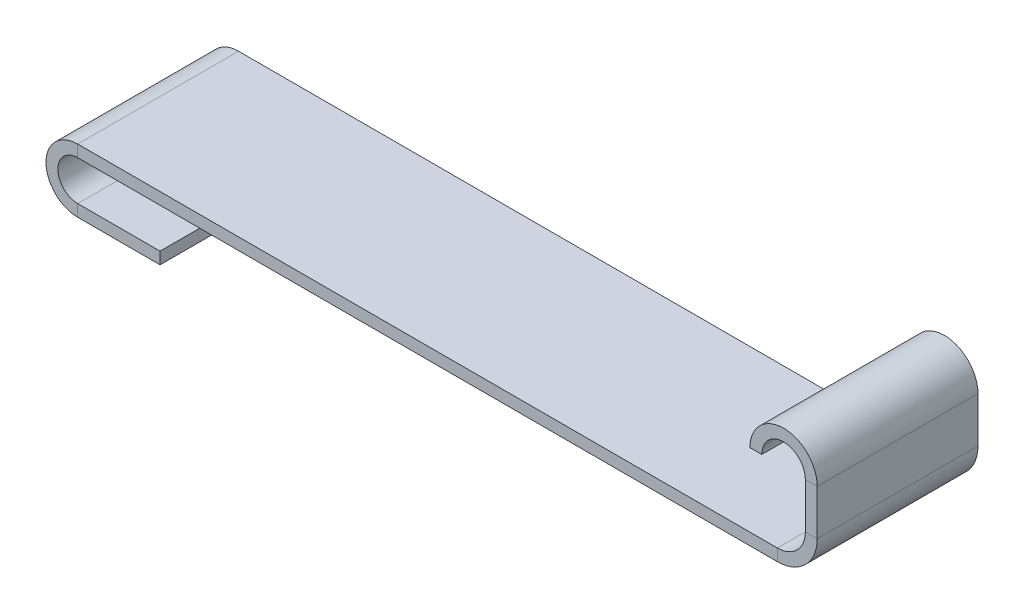
ISO-10303-21;
HEADER;
FILE_DESCRIPTION(('STEP AP214'),'2;1');
FILE_NAME('part.step','',(''),(''),'','','');
FILE_SCHEMA(('AUTOMOTIVE_DESIGN { 1 0 10303 214 1 1 1 1 }'));
ENDSEC;
DATA;
#1=APPLICATION_CONTEXT('core data for automotive mechanical design processes');
#2=APPLICATION_PROTOCOL_DEFINITION('international standard','automotive_design',2000,#1);
#3=PRODUCT_CONTEXT('',#1,'mechanical');
#4=PRODUCT('Part','Part','',(#3));
#5=PRODUCT_RELATED_PRODUCT_CATEGORY('part','',(#4));
#6=PRODUCT_DEFINITION_FORMATION('','',#4);
#7=PRODUCT_DEFINITION_CONTEXT('part definition',#1,'design');
#8=PRODUCT_DEFINITION('design','',#6,#7);
#9=PRODUCT_DEFINITION_SHAPE('','',#8);
#10=(LENGTH_UNIT() NAMED_UNIT(*) SI_UNIT(.MILLI.,.METRE.));
#11=(NAMED_UNIT(*) PLANE_ANGLE_UNIT() SI_UNIT($,.RADIAN.));
#12=(NAMED_UNIT(*) SI_UNIT($,.STERADIAN.) SOLID_ANGLE_UNIT());
#13=UNCERTAINTY_MEASURE_WITH_UNIT(LENGTH_MEASURE(1.E-05),#10,'distance_accuracy_value','');
#14=(GEOMETRIC_REPRESENTATION_CONTEXT(3) GLOBAL_UNCERTAINTY_ASSIGNED_CONTEXT((#13)) GLOBAL_UNIT_ASSIGNED_CONTEXT((#10,
#11,#12)) REPRESENTATION_CONTEXT('',''));
#15=CARTESIAN_POINT('',(0.,0.,0.));
#16=DIRECTION('',(0.,0.,1.));
#17=DIRECTION('',(1.,0.,0.));
#18=AXIS2_PLACEMENT_3D('',#15,#16,#17);
#19=CARTESIAN_POINT('',(0.,-136.17242450755,0.));
#20=DIRECTION('',(0.,-1.,0.));
#21=DIRECTION('',(0.,0.,-1.));
#22=AXIS2_PLACEMENT_3D('',#19,#20,#21);
#23=PLANE('',#22);
#24=DIRECTION('',(-1.,0.,0.));
#25=VECTOR('',#24,1.);
#26=CARTESIAN_POINT('',(109.608225281974,-136.17242450755,19.5334662412144));
#27=LINE('',#26,#25);
#28=CARTESIAN_POINT('',(109.608225281974,-136.17242450755,19.5334662412144));
#29=VERTEX_POINT('',#28);
#30=CARTESIAN_POINT('',(106.722201888825,-136.17242450755,19.5334662412144));
#31=VERTEX_POINT('',#30);
#32=EDGE_CURVE('E160',#29,#31,#27,.T.);
#33=ORIENTED_EDGE('',*,*,#32,.T.);
#34=DIRECTION('',(0.,0.,-1.));
#35=VECTOR('',#34,1.);
#36=CARTESIAN_POINT('',(106.722201888825,-136.17242450755,19.5334662412144));
#37=LINE('',#36,#35);
#38=CARTESIAN_POINT('',(106.722201888825,-136.17242450755,-19.5334662412144));
#39=VERTEX_POINT('',#38);
#40=EDGE_CURVE('E170',#31,#39,#37,.T.);
#41=ORIENTED_EDGE('',*,*,#40,.T.);
#42=DIRECTION('',(1.,0.,0.));
#43=VECTOR('',#42,1.);
#44=CARTESIAN_POINT('',(106.722201888825,-136.17242450755,-19.5334662412144));
#45=LINE('',#44,#43);
#46=CARTESIAN_POINT('',(109.608225281974,-136.17242450755,-19.5334662412144));
#47=VERTEX_POINT('',#46);
#48=EDGE_CURVE('E174',#39,#47,#45,.T.);
#49=ORIENTED_EDGE('',*,*,#48,.T.);
#50=DIRECTION('',(0.,0.,1.));
#51=VECTOR('',#50,1.);
#52=CARTESIAN_POINT('',(109.608225281974,-136.17242450755,-19.5334662412144));
#53=LINE('',#52,#51);
#54=EDGE_CURVE('E173',#47,#29,#53,.T.);
#55=ORIENTED_EDGE('',*,*,#54,.T.);
#56=EDGE_LOOP('',(#33,#41,#49,#55));
#57=FACE_BOUND('',#56,.T.);
#58=ADVANCED_FACE('F40',(#57),#23,.T.);
#59=CARTESIAN_POINT('',(-36.6030034318016,-59.7754279393522,0.));
#60=DIRECTION('',(-1.,0.,0.));
#61=DIRECTION('',(0.,0.,-1.));
#62=AXIS2_PLACEMENT_3D('',#59,#60,#61);
#63=PLANE('',#62);
#64=DIRECTION('',(0.,1.,0.));
#65=VECTOR('',#64,1.);
#66=CARTESIAN_POINT('',(-36.6030034318018,-169.383653221327,19.5334662412144));
#67=LINE('',#66,#65);
#68=CARTESIAN_POINT('',(-36.6030034318018,-169.383653221327,19.5334662412144));
#69=VERTEX_POINT('',#68);
#70=CARTESIAN_POINT('',(-36.6030034318018,-166.497629828178,19.5334662412144));
#71=VERTEX_POINT('',#70);
#72=EDGE_CURVE('E229',#69,#71,#67,.T.);
#73=ORIENTED_EDGE('',*,*,#72,.F.);
#74=DIRECTION('',(0.,0.,1.));
#75=VECTOR('',#74,1.);
#76=CARTESIAN_POINT('',(-36.6030034318018,-169.383653221327,-19.5334662412144));
#77=LINE('',#76,#75);
#78=CARTESIAN_POINT('',(-36.6030034318018,-169.383653221327,-19.5334662412144));
#79=VERTEX_POINT('',#78);
#80=EDGE_CURVE('E11',#79,#69,#77,.T.);
#81=ORIENTED_EDGE('',*,*,#80,.F.);
#82=DIRECTION('',(0.,-1.,0.));
#83=VECTOR('',#82,1.);
#84=CARTESIAN_POINT('',(-36.6030034318018,-166.497629828178,-19.5334662412144));
#85=LINE('',#84,#83);
#86=CARTESIAN_POINT('',(-36.6030034318018,-166.497629828178,-19.5334662412144));
#87=VERTEX_POINT('',#86);
#88=EDGE_CURVE('E54',#87,#79,#85,.T.);
#89=ORIENTED_EDGE('',*,*,#88,.F.);
#90=DIRECTION('',(0.,0.,-1.));
#91=VECTOR('',#90,1.);
#92=CARTESIAN_POINT('',(-36.6030034318018,-166.497629828178,19.5334662412144));
#93=LINE('',#92,#91);
#94=EDGE_CURVE('E63',#71,#87,#93,.T.);
#95=ORIENTED_EDGE('',*,*,#94,.F.);
#96=EDGE_LOOP('',(#73,#81,#89,#95));
#97=FACE_BOUND('',#96,.T.);
#98=ADVANCED_FACE('F353',(#97),#63,.F.);
#99=CARTESIAN_POINT('',(109.608225281974,-136.17242450755,19.5334662412144));
#100=DIRECTION('',(0.,0.,-1.));
#101=DIRECTION('',(-1.,0.,0.));
#102=AXIS2_PLACEMENT_3D('',#99,#100,#101);
#103=PLANE('',#102);
#104=CARTESIAN_POINT('',(114.896996568198,-136.17242450755,19.5334662412144));
#105=DIRECTION('',(0.,0.,-1.));
#106=DIRECTION('',(-1.,0.,0.));
#107=AXIS2_PLACEMENT_3D('',#104,#105,#106);
#108=CIRCLE('',#107,8.17479467937279);
#109=CARTESIAN_POINT('',(123.071791247571,-136.17242450755,19.5334662412144));
#110=VERTEX_POINT('',#109);
#111=EDGE_CURVE('E167',#31,#110,#108,.T.);
#112=ORIENTED_EDGE('',*,*,#111,.F.);
#113=ORIENTED_EDGE('',*,*,#32,.F.);
#114=CARTESIAN_POINT('',(114.896996568198,-136.17242450755,19.5334662412144));
#115=DIRECTION('',(0.,0.,-1.));
#116=DIRECTION('',(-1.,0.,0.));
#117=AXIS2_PLACEMENT_3D('',#114,#115,#116);
#118=CIRCLE('',#117,5.2887712862239);
#119=CARTESIAN_POINT('',(120.185767854422,-136.17242450755,19.5334662412144));
#120=VERTEX_POINT('',#119);
#121=EDGE_CURVE('E165',#29,#120,#118,.T.);
#122=ORIENTED_EDGE('',*,*,#121,.T.);
#123=DIRECTION('',(1.,0.,0.));
#124=VECTOR('',#123,1.);
#125=CARTESIAN_POINT('',(120.185767854422,-136.17242450755,19.5334662412144));
#126=LINE('',#125,#124);
#127=EDGE_CURVE('E184',#120,#110,#126,.T.);
#128=ORIENTED_EDGE('',*,*,#127,.T.);
#129=EDGE_LOOP('',(#112,#113,#122,#128));
#130=FACE_BOUND('',#129,.T.);
#131=ADVANCED_FACE('F162',(#130),#103,.F.);
#132=CARTESIAN_POINT('',(114.896996568198,-136.17242450755,0.));
#133=DIRECTION('',(0.,0.,-1.));
#134=DIRECTION('',(-1.,0.,0.));
#135=AXIS2_PLACEMENT_3D('',#132,#133,#134);
#136=CYLINDRICAL_SURFACE('',#135,8.17479467937279);
#137=CARTESIAN_POINT('',(114.896996568198,-136.17242450755,-19.5334662412144));
#138=DIRECTION('',(0.,0.,-1.));
#139=DIRECTION('',(-1.,0.,0.));
#140=AXIS2_PLACEMENT_3D('',#137,#138,#139);
#141=CIRCLE('',#140,8.17479467937279);
#142=CARTESIAN_POINT('',(123.071791247571,-136.17242450755,-19.5334662412144));
#143=VERTEX_POINT('',#142);
#144=EDGE_CURVE('E240',#39,#143,#141,.T.);
#145=ORIENTED_EDGE('',*,*,#144,.F.);
#146=ORIENTED_EDGE('',*,*,#40,.F.);
#147=ORIENTED_EDGE('',*,*,#111,.T.);
#148=DIRECTION('',(0.,0.,-1.));
#149=VECTOR('',#148,1.);
#150=CARTESIAN_POINT('',(123.071791247571,-136.17242450755,19.5334662412144));
#151=LINE('',#150,#149);
#152=EDGE_CURVE('E237',#110,#143,#151,.T.);
#153=ORIENTED_EDGE('',*,*,#152,.T.);
#154=EDGE_LOOP('',(#145,#146,#147,#153));
#155=FACE_BOUND('',#154,.T.);
#156=ADVANCED_FACE('F360',(#155),#136,.T.);
#157=CARTESIAN_POINT('',(106.722201888825,-136.17242450755,-19.5334662412144));
#158=DIRECTION('',(0.,0.,1.));
#159=DIRECTION('',(1.,0.,0.));
#160=AXIS2_PLACEMENT_3D('',#157,#158,#159);
#161=PLANE('',#160);
#162=CARTESIAN_POINT('',(114.896996568198,-136.17242450755,-19.5334662412144));
#163=DIRECTION('',(0.,0.,-1.));
#164=DIRECTION('',(-1.,0.,0.));
#165=AXIS2_PLACEMENT_3D('',#162,#163,#164);
#166=CIRCLE('',#165,5.2887712862239);
#167=CARTESIAN_POINT('',(120.185767854422,-136.17242450755,-19.5334662412144));
#168=VERTEX_POINT('',#167);
#169=EDGE_CURVE('E270',#47,#168,#166,.T.);
#170=ORIENTED_EDGE('',*,*,#169,.F.);
#171=ORIENTED_EDGE('',*,*,#48,.F.);
#172=ORIENTED_EDGE('',*,*,#144,.T.);
#173=DIRECTION('',(-1.,0.,0.));
#174=VECTOR('',#173,1.);
#175=CARTESIAN_POINT('',(123.071791247571,-136.17242450755,-19.5334662412144));
#176=LINE('',#175,#174);
#177=EDGE_CURVE('E243',#143,#168,#176,.T.);
#178=ORIENTED_EDGE('',*,*,#177,.T.);
#179=EDGE_LOOP('',(#170,#171,#172,#178));
#180=FACE_BOUND('',#179,.T.);
#181=ADVANCED_FACE('F341',(#180),#161,.F.);
#182=CARTESIAN_POINT('',(114.896996568198,-136.17242450755,0.));
#183=DIRECTION('',(0.,0.,-1.));
#184=DIRECTION('',(-1.,0.,0.));
#185=AXIS2_PLACEMENT_3D('',#182,#183,#184);
#186=CYLINDRICAL_SURFACE('',#185,5.2887712862239);
#187=DIRECTION('',(0.,0.,1.));
#188=VECTOR('',#187,1.);
#189=CARTESIAN_POINT('',(120.185767854422,-136.17242450755,-19.5334662412144));
#190=LINE('',#189,#188);
#191=EDGE_CURVE('E182',#168,#120,#190,.T.);
#192=ORIENTED_EDGE('',*,*,#191,.T.);
#193=ORIENTED_EDGE('',*,*,#121,.F.);
#194=ORIENTED_EDGE('',*,*,#54,.F.);
#195=ORIENTED_EDGE('',*,*,#169,.T.);
#196=EDGE_LOOP('',(#192,#193,#194,#195));
#197=FACE_BOUND('',#196,.T.);
#198=ADVANCED_FACE('F180',(#197),#186,.F.);
#199=CARTESIAN_POINT('',(120.185767854422,-136.17242450755,19.5334662412144));
#200=DIRECTION('',(0.,0.,-1.));
#201=DIRECTION('',(-1.,0.,0.));
#202=AXIS2_PLACEMENT_3D('',#199,#200,#201);
#203=PLANE('',#202);
#204=DIRECTION('',(0.,-1.,0.));
#205=VECTOR('',#204,1.);
#206=CARTESIAN_POINT('',(123.071791247571,-136.17242450755,19.5334662412144));
#207=LINE('',#206,#205);
#208=CARTESIAN_POINT('',(123.071791247571,-147.17242450755,19.5334662412144));
#209=VERTEX_POINT('',#208);
#210=EDGE_CURVE('E192',#110,#209,#207,.T.);
#211=ORIENTED_EDGE('',*,*,#210,.F.);
#212=ORIENTED_EDGE('',*,*,#127,.F.);
#213=DIRECTION('',(0.,-1.,0.));
#214=VECTOR('',#213,1.);
#215=CARTESIAN_POINT('',(120.185767854422,-136.17242450755,19.5334662412144));
#216=LINE('',#215,#214);
#217=CARTESIAN_POINT('',(120.185767854422,-147.17242450755,19.5334662412144));
#218=VERTEX_POINT('',#217);
#219=EDGE_CURVE('E193',#120,#218,#216,.T.);
#220=ORIENTED_EDGE('',*,*,#219,.T.);
#221=DIRECTION('',(1.,0.,0.));
#222=VECTOR('',#221,1.);
#223=CARTESIAN_POINT('',(120.185767854422,-147.17242450755,19.5334662412144));
#224=LINE('',#223,#222);
#225=EDGE_CURVE('E189',#218,#209,#224,.T.);
#226=ORIENTED_EDGE('',*,*,#225,.T.);
#227=EDGE_LOOP('',(#211,#212,#220,#226));
#228=FACE_BOUND('',#227,.T.);
#229=ADVANCED_FACE('F340',(#228),#203,.F.);
#230=CARTESIAN_POINT('',(123.071791247571,-136.17242450755,19.5334662412144));
#231=DIRECTION('',(-1.,0.,0.));
#232=DIRECTION('',(0.,-1.,0.));
#233=AXIS2_PLACEMENT_3D('',#230,#231,#232);
#234=PLANE('',#233);
#235=DIRECTION('',(0.,-1.,0.));
#236=VECTOR('',#235,1.);
#237=CARTESIAN_POINT('',(123.071791247571,-136.17242450755,-19.5334662412144));
#238=LINE('',#237,#236);
#239=CARTESIAN_POINT('',(123.071791247571,-147.17242450755,-19.5334662412144));
#240=VERTEX_POINT('',#239);
#241=EDGE_CURVE('E246',#143,#240,#238,.T.);
#242=ORIENTED_EDGE('',*,*,#241,.F.);
#243=ORIENTED_EDGE('',*,*,#152,.F.);
#244=ORIENTED_EDGE('',*,*,#210,.T.);
#245=DIRECTION('',(0.,0.,-1.));
#246=VECTOR('',#245,1.);
#247=CARTESIAN_POINT('',(123.071791247571,-147.17242450755,19.5334662412144));
#248=LINE('',#247,#246);
#249=EDGE_CURVE('E196',#209,#240,#248,.T.);
#250=ORIENTED_EDGE('',*,*,#249,.T.);
#251=EDGE_LOOP('',(#242,#243,#244,#250));
#252=FACE_BOUND('',#251,.T.);
#253=ADVANCED_FACE('F377',(#252),#234,.F.);
#254=CARTESIAN_POINT('',(123.071791247571,-136.17242450755,-19.5334662412144));
#255=DIRECTION('',(0.,0.,1.));
#256=DIRECTION('',(1.,0.,0.));
#257=AXIS2_PLACEMENT_3D('',#254,#255,#256);
#258=PLANE('',#257);
#259=DIRECTION('',(0.,-1.,0.));
#260=VECTOR('',#259,1.);
#261=CARTESIAN_POINT('',(120.185767854422,-136.17242450755,-19.5334662412144));
#262=LINE('',#261,#260);
#263=CARTESIAN_POINT('',(120.185767854422,-147.17242450755,-19.5334662412144));
#264=VERTEX_POINT('',#263);
#265=EDGE_CURVE('E274',#168,#264,#262,.T.);
#266=ORIENTED_EDGE('',*,*,#265,.F.);
#267=ORIENTED_EDGE('',*,*,#177,.F.);
#268=ORIENTED_EDGE('',*,*,#241,.T.);
#269=DIRECTION('',(-1.,0.,0.));
#270=VECTOR('',#269,1.);
#271=CARTESIAN_POINT('',(123.071791247571,-147.17242450755,-19.5334662412144));
#272=LINE('',#271,#270);
#273=EDGE_CURVE('E249',#240,#264,#272,.T.);
#274=ORIENTED_EDGE('',*,*,#273,.T.);
#275=EDGE_LOOP('',(#266,#267,#268,#274));
#276=FACE_BOUND('',#275,.T.);
#277=ADVANCED_FACE('F346',(#276),#258,.F.);
#278=CARTESIAN_POINT('',(120.185767854422,-136.17242450755,-19.5334662412144));
#279=DIRECTION('',(1.,0.,0.));
#280=DIRECTION('',(0.,1.,0.));
#281=AXIS2_PLACEMENT_3D('',#278,#279,#280);
#282=PLANE('',#281);
#283=DIRECTION('',(0.,0.,1.));
#284=VECTOR('',#283,1.);
#285=CARTESIAN_POINT('',(120.185767854422,-147.17242450755,-19.5334662412144));
#286=LINE('',#285,#284);
#287=EDGE_CURVE('E209',#264,#218,#286,.T.);
#288=ORIENTED_EDGE('',*,*,#287,.T.);
#289=ORIENTED_EDGE('',*,*,#219,.F.);
#290=ORIENTED_EDGE('',*,*,#191,.F.);
#291=ORIENTED_EDGE('',*,*,#265,.T.);
#292=EDGE_LOOP('',(#288,#289,#290,#291));
#293=FACE_BOUND('',#292,.T.);
#294=ADVANCED_FACE('F342',(#293),#282,.F.);
#295=CARTESIAN_POINT('',(120.185767854422,-147.17242450755,19.5334662412144));
#296=DIRECTION('',(0.,0.,-1.));
#297=DIRECTION('',(-1.,0.,0.));
#298=AXIS2_PLACEMENT_3D('',#295,#296,#297);
#299=PLANE('',#298);
#300=CARTESIAN_POINT('',(113.396996568198,-147.17242450755,19.5334662412144));
#301=DIRECTION('',(0.,0.,-1.));
#302=DIRECTION('',(1.,0.,0.));
#303=AXIS2_PLACEMENT_3D('',#300,#301,#302);
#304=CIRCLE('',#303,9.67479467937277);
#305=CARTESIAN_POINT('',(113.396996568198,-156.847219186923,19.5334662412144));
#306=VERTEX_POINT('',#305);
#307=EDGE_CURVE('E202',#209,#306,#304,.T.);
#308=ORIENTED_EDGE('',*,*,#307,.F.);
#309=ORIENTED_EDGE('',*,*,#225,.F.);
#310=CARTESIAN_POINT('',(113.396996568198,-147.17242450755,19.5334662412144));
#311=DIRECTION('',(0.,0.,-1.));
#312=DIRECTION('',(1.,0.,0.));
#313=AXIS2_PLACEMENT_3D('',#310,#311,#312);
#314=CIRCLE('',#313,6.78877128622388);
#315=CARTESIAN_POINT('',(113.396996568198,-153.961195793774,19.5334662412144));
#316=VERTEX_POINT('',#315);
#317=EDGE_CURVE('E203',#218,#316,#314,.T.);
#318=ORIENTED_EDGE('',*,*,#317,.T.);
#319=DIRECTION('',(0.,-1.,0.));
#320=VECTOR('',#319,1.);
#321=CARTESIAN_POINT('',(113.396996568198,-153.961195793774,19.5334662412144));
#322=LINE('',#321,#320);
#323=EDGE_CURVE('E199',#316,#306,#322,.T.);
#324=ORIENTED_EDGE('',*,*,#323,.T.);
#325=EDGE_LOOP('',(#308,#309,#318,#324));
#326=FACE_BOUND('',#325,.T.);
#327=ADVANCED_FACE('F345',(#326),#299,.F.);
#328=CARTESIAN_POINT('',(113.396996568198,-147.17242450755,0.));
#329=DIRECTION('',(0.,0.,-1.));
#330=DIRECTION('',(-1.,0.,0.));
#331=AXIS2_PLACEMENT_3D('',#328,#329,#330);
#332=CYLINDRICAL_SURFACE('',#331,9.67479467937277);
#333=CARTESIAN_POINT('',(113.396996568198,-147.17242450755,-19.5334662412144));
#334=DIRECTION('',(0.,0.,-1.));
#335=DIRECTION('',(1.,0.,0.));
#336=AXIS2_PLACEMENT_3D('',#333,#334,#335);
#337=CIRCLE('',#336,9.67479467937277);
#338=CARTESIAN_POINT('',(113.396996568198,-156.847219186923,-19.5334662412144));
#339=VERTEX_POINT('',#338);
#340=EDGE_CURVE('E252',#240,#339,#337,.T.);
#341=ORIENTED_EDGE('',*,*,#340,.F.);
#342=ORIENTED_EDGE('',*,*,#249,.F.);
#343=ORIENTED_EDGE('',*,*,#307,.T.);
#344=DIRECTION('',(0.,0.,-1.));
#345=VECTOR('',#344,1.);
#346=CARTESIAN_POINT('',(113.396996568198,-156.847219186923,19.5334662412144));
#347=LINE('',#346,#345);
#348=EDGE_CURVE('E206',#306,#339,#347,.T.);
#349=ORIENTED_EDGE('',*,*,#348,.T.);
#350=EDGE_LOOP('',(#341,#342,#343,#349));
#351=FACE_BOUND('',#350,.T.);
#352=ADVANCED_FACE('F369',(#351),#332,.T.);
#353=CARTESIAN_POINT('',(123.071791247571,-147.17242450755,-19.5334662412144));
#354=DIRECTION('',(0.,0.,1.));
#355=DIRECTION('',(1.,0.,0.));
#356=AXIS2_PLACEMENT_3D('',#353,#354,#355);
#357=PLANE('',#356);
#358=CARTESIAN_POINT('',(113.396996568198,-147.17242450755,-19.5334662412144));
#359=DIRECTION('',(0.,0.,-1.));
#360=DIRECTION('',(1.,0.,0.));
#361=AXIS2_PLACEMENT_3D('',#358,#359,#360);
#362=CIRCLE('',#361,6.78877128622388);
#363=CARTESIAN_POINT('',(113.396996568198,-153.961195793774,-19.5334662412144));
#364=VERTEX_POINT('',#363);
#365=EDGE_CURVE('E279',#264,#364,#362,.T.);
#366=ORIENTED_EDGE('',*,*,#365,.F.);
#367=ORIENTED_EDGE('',*,*,#273,.F.);
#368=ORIENTED_EDGE('',*,*,#340,.T.);
#369=DIRECTION('',(0.,1.,0.));
#370=VECTOR('',#369,1.);
#371=CARTESIAN_POINT('',(113.396996568198,-156.847219186923,-19.5334662412144));
#372=LINE('',#371,#370);
#373=EDGE_CURVE('E255',#339,#364,#372,.T.);
#374=ORIENTED_EDGE('',*,*,#373,.T.);
#375=EDGE_LOOP('',(#366,#367,#368,#374));
#376=FACE_BOUND('',#375,.T.);
#377=ADVANCED_FACE('F319',(#376),#357,.F.);
#378=CARTESIAN_POINT('',(113.396996568198,-147.17242450755,0.));
#379=DIRECTION('',(0.,0.,-1.));
#380=DIRECTION('',(-1.,0.,0.));
#381=AXIS2_PLACEMENT_3D('',#378,#379,#380);
#382=CYLINDRICAL_SURFACE('',#381,6.78877128622388);
#383=DIRECTION('',(0.,0.,1.));
#384=VECTOR('',#383,1.);
#385=CARTESIAN_POINT('',(113.396996568198,-153.961195793774,-19.5334662412144));
#386=LINE('',#385,#384);
#387=EDGE_CURVE('E220',#364,#316,#386,.T.);
#388=ORIENTED_EDGE('',*,*,#387,.T.);
#389=ORIENTED_EDGE('',*,*,#317,.F.);
#390=ORIENTED_EDGE('',*,*,#287,.F.);
#391=ORIENTED_EDGE('',*,*,#365,.T.);
#392=EDGE_LOOP('',(#388,#389,#390,#391));
#393=FACE_BOUND('',#392,.T.);
#394=ADVANCED_FACE('F314',(#393),#382,.F.);
#395=CARTESIAN_POINT('',(113.396996568198,-153.961195793774,19.5334662412144));
#396=DIRECTION('',(0.,0.,-1.));
#397=DIRECTION('',(-1.,0.,0.));
#398=AXIS2_PLACEMENT_3D('',#395,#396,#397);
#399=PLANE('',#398);
#400=DIRECTION('',(-1.,0.,0.));
#401=VECTOR('',#400,1.);
#402=CARTESIAN_POINT('',(113.396996568198,-156.847219186923,19.5334662412144));
#403=LINE('',#402,#401);
#404=CARTESIAN_POINT('',(-56.6030034318018,-156.847219186923,19.5334662412144));
#405=VERTEX_POINT('',#404);
#406=EDGE_CURVE('E213',#306,#405,#403,.T.);
#407=ORIENTED_EDGE('',*,*,#406,.F.);
#408=ORIENTED_EDGE('',*,*,#323,.F.);
#409=DIRECTION('',(-1.,0.,0.));
#410=VECTOR('',#409,1.);
#411=CARTESIAN_POINT('',(113.396996568198,-153.961195793774,19.5334662412144));
#412=LINE('',#411,#410);
#413=CARTESIAN_POINT('',(-56.6030034318018,-153.961195793774,19.5334662412144));
#414=VERTEX_POINT('',#413);
#415=EDGE_CURVE('E214',#316,#414,#412,.T.);
#416=ORIENTED_EDGE('',*,*,#415,.T.);
#417=DIRECTION('',(0.,-1.,0.));
#418=VECTOR('',#417,1.);
#419=CARTESIAN_POINT('',(-56.6030034318018,-153.961195793774,19.5334662412144));
#420=LINE('',#419,#418);
#421=EDGE_CURVE('E210',#414,#405,#420,.T.);
#422=ORIENTED_EDGE('',*,*,#421,.T.);
#423=EDGE_LOOP('',(#407,#408,#416,#422));
#424=FACE_BOUND('',#423,.T.);
#425=ADVANCED_FACE('F309',(#424),#399,.F.);
#426=CARTESIAN_POINT('',(113.396996568198,-156.847219186923,19.5334662412144));
#427=DIRECTION('',(0.,1.,0.));
#428=DIRECTION('',(-1.,0.,0.));
#429=AXIS2_PLACEMENT_3D('',#426,#427,#428);
#430=PLANE('',#429);
#431=DIRECTION('',(-1.,0.,0.));
#432=VECTOR('',#431,1.);
#433=CARTESIAN_POINT('',(113.396996568198,-156.847219186923,-19.5334662412144));
#434=LINE('',#433,#432);
#435=CARTESIAN_POINT('',(-56.6030034318018,-156.847219186923,-19.5334662412144));
#436=VERTEX_POINT('',#435);
#437=EDGE_CURVE('E258',#339,#436,#434,.T.);
#438=ORIENTED_EDGE('',*,*,#437,.F.);
#439=ORIENTED_EDGE('',*,*,#348,.F.);
#440=ORIENTED_EDGE('',*,*,#406,.T.);
#441=DIRECTION('',(0.,0.,-1.));
#442=VECTOR('',#441,1.);
#443=CARTESIAN_POINT('',(-56.6030034318018,-156.847219186923,19.5334662412144));
#444=LINE('',#443,#442);
#445=EDGE_CURVE('E217',#405,#436,#444,.T.);
#446=ORIENTED_EDGE('',*,*,#445,.T.);
#447=EDGE_LOOP('',(#438,#439,#440,#446));
#448=FACE_BOUND('',#447,.T.);
#449=ADVANCED_FACE('F366',(#448),#430,.F.);
#450=CARTESIAN_POINT('',(113.396996568198,-156.847219186923,-19.5334662412144));
#451=DIRECTION('',(0.,0.,1.));
#452=DIRECTION('',(1.,0.,0.));
#453=AXIS2_PLACEMENT_3D('',#450,#451,#452);
#454=PLANE('',#453);
#455=DIRECTION('',(-1.,0.,0.));
#456=VECTOR('',#455,1.);
#457=CARTESIAN_POINT('',(113.396996568198,-153.961195793774,-19.5334662412144));
#458=LINE('',#457,#456);
#459=CARTESIAN_POINT('',(-56.6030034318018,-153.961195793774,-19.5334662412144));
#460=VERTEX_POINT('',#459);
#461=EDGE_CURVE('E284',#364,#460,#458,.T.);
#462=ORIENTED_EDGE('',*,*,#461,.F.);
#463=ORIENTED_EDGE('',*,*,#373,.F.);
#464=ORIENTED_EDGE('',*,*,#437,.T.);
#465=DIRECTION('',(0.,1.,0.));
#466=VECTOR('',#465,1.);
#467=CARTESIAN_POINT('',(-56.6030034318018,-156.847219186923,-19.5334662412144));
#468=LINE('',#467,#466);
#469=EDGE_CURVE('E261',#436,#460,#468,.T.);
#470=ORIENTED_EDGE('',*,*,#469,.T.);
#471=EDGE_LOOP('',(#462,#463,#464,#470));
#472=FACE_BOUND('',#471,.T.);
#473=ADVANCED_FACE('F321',(#472),#454,.F.);
#474=CARTESIAN_POINT('',(113.396996568198,-153.961195793774,-19.5334662412144));
#475=DIRECTION('',(0.,-1.,0.));
#476=DIRECTION('',(1.,0.,0.));
#477=AXIS2_PLACEMENT_3D('',#474,#475,#476);
#478=PLANE('',#477);
#479=DIRECTION('',(0.,0.,1.));
#480=VECTOR('',#479,1.);
#481=CARTESIAN_POINT('',(-56.6030034318018,-153.961195793774,-19.5334662412144));
#482=LINE('',#481,#480);
#483=EDGE_CURVE('E228',#460,#414,#482,.T.);
#484=ORIENTED_EDGE('',*,*,#483,.T.);
#485=ORIENTED_EDGE('',*,*,#415,.F.);
#486=ORIENTED_EDGE('',*,*,#387,.F.);
#487=ORIENTED_EDGE('',*,*,#461,.T.);
#488=EDGE_LOOP('',(#484,#485,#486,#487));
#489=FACE_BOUND('',#488,.T.);
#490=ADVANCED_FACE('F312',(#489),#478,.F.);
#491=CARTESIAN_POINT('',(-56.6030034318018,-153.961195793774,19.5334662412144));
#492=DIRECTION('',(0.,0.,-1.));
#493=DIRECTION('',(-1.,0.,0.));
#494=AXIS2_PLACEMENT_3D('',#491,#492,#493);
#495=PLANE('',#494);
#496=CARTESIAN_POINT('',(-56.6030034318018,-161.67242450755,19.5334662412144));
#497=DIRECTION('',(0.,0.,1.));
#498=DIRECTION('',(0.,1.,0.));
#499=AXIS2_PLACEMENT_3D('',#496,#497,#498);
#500=CIRCLE('',#499,4.82520532062722);
#501=CARTESIAN_POINT('',(-56.6030034318018,-166.497629828178,19.5334662412144));
#502=VERTEX_POINT('',#501);
#503=EDGE_CURVE('E136',#405,#502,#500,.T.);
#504=ORIENTED_EDGE('',*,*,#503,.F.);
#505=ORIENTED_EDGE('',*,*,#421,.F.);
#506=CARTESIAN_POINT('',(-56.6030034318018,-161.67242450755,19.5334662412144));
#507=DIRECTION('',(0.,0.,1.));
#508=DIRECTION('',(0.,1.,0.));
#509=AXIS2_PLACEMENT_3D('',#506,#507,#508);
#510=CIRCLE('',#509,7.71122871377611);
#511=CARTESIAN_POINT('',(-56.6030034318018,-169.383653221326,19.5334662412144));
#512=VERTEX_POINT('',#511);
#513=EDGE_CURVE('E223',#414,#512,#510,.T.);
#514=ORIENTED_EDGE('',*,*,#513,.T.);
#515=DIRECTION('',(0.,1.,0.));
#516=VECTOR('',#515,1.);
#517=CARTESIAN_POINT('',(-56.6030034318018,-169.383653221326,19.5334662412144));
#518=LINE('',#517,#516);
#519=EDGE_CURVE('E221',#512,#502,#518,.T.);
#520=ORIENTED_EDGE('',*,*,#519,.T.);
#521=EDGE_LOOP('',(#504,#505,#514,#520));
#522=FACE_BOUND('',#521,.T.);
#523=ADVANCED_FACE('F306',(#522),#495,.F.);
#524=CARTESIAN_POINT('',(-56.6030034318018,-161.67242450755,0.));
#525=DIRECTION('',(0.,0.,1.));
#526=DIRECTION('',(1.,0.,0.));
#527=AXIS2_PLACEMENT_3D('',#524,#525,#526);
#528=CYLINDRICAL_SURFACE('',#527,4.82520532062722);
#529=CARTESIAN_POINT('',(-56.6030034318018,-161.67242450755,-19.5334662412144));
#530=DIRECTION('',(0.,0.,1.));
#531=DIRECTION('',(0.,1.,0.));
#532=AXIS2_PLACEMENT_3D('',#529,#530,#531);
#533=CIRCLE('',#532,4.82520532062722);
#534=CARTESIAN_POINT('',(-56.6030034318018,-166.497629828178,-19.5334662412144));
#535=VERTEX_POINT('',#534);
#536=EDGE_CURVE('E129',#436,#535,#533,.T.);
#537=ORIENTED_EDGE('',*,*,#536,.F.);
#538=ORIENTED_EDGE('',*,*,#445,.F.);
#539=ORIENTED_EDGE('',*,*,#503,.T.);
#540=DIRECTION('',(0.,0.,-1.));
#541=VECTOR('',#540,1.);
#542=CARTESIAN_POINT('',(-56.6030034318018,-166.497629828178,19.5334662412144));
#543=LINE('',#542,#541);
#544=EDGE_CURVE('E225',#502,#535,#543,.T.);
#545=ORIENTED_EDGE('',*,*,#544,.T.);
#546=EDGE_LOOP('',(#537,#538,#539,#545));
#547=FACE_BOUND('',#546,.T.);
#548=ADVANCED_FACE('F363',(#547),#528,.F.);
#549=CARTESIAN_POINT('',(-56.6030034318018,-156.847219186923,-19.5334662412144));
#550=DIRECTION('',(0.,0.,1.));
#551=DIRECTION('',(1.,0.,0.));
#552=AXIS2_PLACEMENT_3D('',#549,#550,#551);
#553=PLANE('',#552);
#554=CARTESIAN_POINT('',(-56.6030034318018,-161.67242450755,-19.5334662412144));
#555=DIRECTION('',(0.,0.,1.));
#556=DIRECTION('',(0.,1.,0.));
#557=AXIS2_PLACEMENT_3D('',#554,#555,#556);
#558=CIRCLE('',#557,7.71122871377611);
#559=CARTESIAN_POINT('',(-56.6030034318018,-169.383653221326,-19.5334662412144));
#560=VERTEX_POINT('',#559);
#561=EDGE_CURVE('E289',#460,#560,#558,.T.);
#562=ORIENTED_EDGE('',*,*,#561,.F.);
#563=ORIENTED_EDGE('',*,*,#469,.F.);
#564=ORIENTED_EDGE('',*,*,#536,.T.);
#565=DIRECTION('',(0.,-1.,0.));
#566=VECTOR('',#565,1.);
#567=CARTESIAN_POINT('',(-56.6030034318018,-166.497629828178,-19.5334662412144));
#568=LINE('',#567,#566);
#569=EDGE_CURVE('E264',#535,#560,#568,.T.);
#570=ORIENTED_EDGE('',*,*,#569,.T.);
#571=EDGE_LOOP('',(#562,#563,#564,#570));
#572=FACE_BOUND('',#571,.T.);
#573=ADVANCED_FACE('F323',(#572),#553,.F.);
#574=CARTESIAN_POINT('',(-56.6030034318018,-161.67242450755,0.));
#575=DIRECTION('',(0.,0.,1.));
#576=DIRECTION('',(1.,0.,0.));
#577=AXIS2_PLACEMENT_3D('',#574,#575,#576);
#578=CYLINDRICAL_SURFACE('',#577,7.71122871377611);
#579=DIRECTION('',(0.,0.,1.));
#580=VECTOR('',#579,1.);
#581=CARTESIAN_POINT('',(-56.6030034318018,-169.383653221326,-19.5334662412144));
#582=LINE('',#581,#580);
#583=EDGE_CURVE('E235',#560,#512,#582,.T.);
#584=ORIENTED_EDGE('',*,*,#583,.T.);
#585=ORIENTED_EDGE('',*,*,#513,.F.);
#586=ORIENTED_EDGE('',*,*,#483,.F.);
#587=ORIENTED_EDGE('',*,*,#561,.T.);
#588=EDGE_LOOP('',(#584,#585,#586,#587));
#589=FACE_BOUND('',#588,.T.);
#590=ADVANCED_FACE('F302',(#589),#578,.T.);
#591=CARTESIAN_POINT('',(-56.6030034318018,-169.383653221326,19.5334662412144));
#592=DIRECTION('',(0.,0.,-1.));
#593=DIRECTION('',(-1.,0.,0.));
#594=AXIS2_PLACEMENT_3D('',#591,#592,#593);
#595=PLANE('',#594);
#596=DIRECTION('',(1.,0.,0.));
#597=VECTOR('',#596,1.);
#598=CARTESIAN_POINT('',(-56.6030034318018,-166.497629828178,19.5334662412144));
#599=LINE('',#598,#597);
#600=EDGE_CURVE('E107',#502,#71,#599,.T.);
#601=ORIENTED_EDGE('',*,*,#600,.F.);
#602=ORIENTED_EDGE('',*,*,#519,.F.);
#603=DIRECTION('',(1.,0.,0.));
#604=VECTOR('',#603,1.);
#605=CARTESIAN_POINT('',(-56.6030034318018,-169.383653221326,19.5334662412144));
#606=LINE('',#605,#604);
#607=EDGE_CURVE('E231',#512,#69,#606,.T.);
#608=ORIENTED_EDGE('',*,*,#607,.T.);
#609=ORIENTED_EDGE('',*,*,#72,.T.);
#610=EDGE_LOOP('',(#601,#602,#608,#609));
#611=FACE_BOUND('',#610,.T.);
#612=ADVANCED_FACE('F305',(#611),#595,.F.);
#613=CARTESIAN_POINT('',(-56.6030034318018,-166.497629828178,19.5334662412144));
#614=DIRECTION('',(0.,-1.,0.));
#615=DIRECTION('',(1.,0.,0.));
#616=AXIS2_PLACEMENT_3D('',#613,#614,#615);
#617=PLANE('',#616);
#618=DIRECTION('',(1.,0.,0.));
#619=VECTOR('',#618,1.);
#620=CARTESIAN_POINT('',(-56.6030034318018,-166.497629828178,-19.5334662412144));
#621=LINE('',#620,#619);
#622=EDGE_CURVE('E102',#535,#87,#621,.T.);
#623=ORIENTED_EDGE('',*,*,#622,.F.);
#624=ORIENTED_EDGE('',*,*,#544,.F.);
#625=ORIENTED_EDGE('',*,*,#600,.T.);
#626=ORIENTED_EDGE('',*,*,#94,.T.);
#627=EDGE_LOOP('',(#623,#624,#625,#626));
#628=FACE_BOUND('',#627,.T.);
#629=ADVANCED_FACE('F327',(#628),#617,.F.);
#630=CARTESIAN_POINT('',(-56.6030034318018,-166.497629828178,-19.5334662412144));
#631=DIRECTION('',(0.,0.,1.));
#632=DIRECTION('',(1.,0.,0.));
#633=AXIS2_PLACEMENT_3D('',#630,#631,#632);
#634=PLANE('',#633);
#635=DIRECTION('',(1.,0.,0.));
#636=VECTOR('',#635,1.);
#637=CARTESIAN_POINT('',(-56.6030034318018,-169.383653221326,-19.5334662412144));
#638=LINE('',#637,#636);
#639=EDGE_CURVE('E47',#560,#79,#638,.T.);
#640=ORIENTED_EDGE('',*,*,#639,.F.);
#641=ORIENTED_EDGE('',*,*,#569,.F.);
#642=ORIENTED_EDGE('',*,*,#622,.T.);
#643=ORIENTED_EDGE('',*,*,#88,.T.);
#644=EDGE_LOOP('',(#640,#641,#642,#643));
#645=FACE_BOUND('',#644,.T.);
#646=ADVANCED_FACE('F324',(#645),#634,.F.);
#647=CARTESIAN_POINT('',(-56.6030034318018,-169.383653221326,-19.5334662412144));
#648=DIRECTION('',(0.,1.,0.));
#649=DIRECTION('',(-1.,0.,0.));
#650=AXIS2_PLACEMENT_3D('',#647,#648,#649);
#651=PLANE('',#650);
#652=ORIENTED_EDGE('',*,*,#80,.T.);
#653=ORIENTED_EDGE('',*,*,#607,.F.);
#654=ORIENTED_EDGE('',*,*,#583,.F.);
#655=ORIENTED_EDGE('',*,*,#639,.T.);
#656=EDGE_LOOP('',(#652,#653,#654,#655));
#657=FACE_BOUND('',#656,.T.);
#658=ADVANCED_FACE('F326',(#657),#651,.F.);
#659=CLOSED_SHELL('',(#58,#98,#131,#156,#181,#198,#229,#253,#277,#294,#327,#352,#377,#394,#425,
#449,#473,#490,#523,#548,#573,#590,#612,#629,#646,#658));
#660=MANIFOLD_SOLID_BREP('B2',#659);
#661=ADVANCED_BREP_SHAPE_REPRESENTATION('',(#18,#660),#14);
#662=SHAPE_DEFINITION_REPRESENTATION(#9,#661);
ENDSEC;
END-ISO-10303-21;
